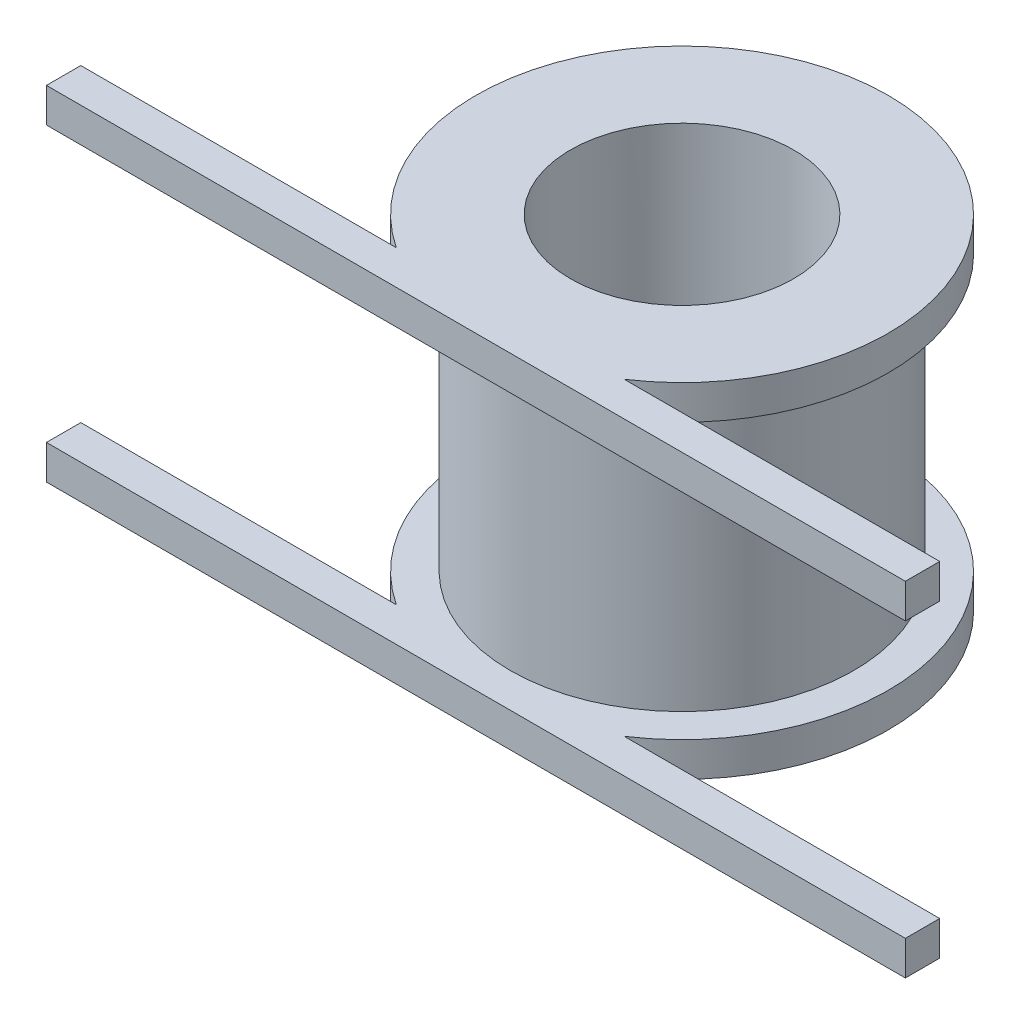
ISO-10303-21;
HEADER;
FILE_DESCRIPTION(('STEP AP214'),'2;1');
FILE_NAME('part.step','',(''),(''),'','','');
FILE_SCHEMA(('AUTOMOTIVE_DESIGN { 1 0 10303 214 1 1 1 1 }'));
ENDSEC;
DATA;
#1=APPLICATION_CONTEXT('core data for automotive mechanical design processes');
#2=APPLICATION_PROTOCOL_DEFINITION('international standard','automotive_design',2000,#1);
#3=PRODUCT_CONTEXT('',#1,'mechanical');
#4=PRODUCT('Part','Part','',(#3));
#5=PRODUCT_RELATED_PRODUCT_CATEGORY('part','',(#4));
#6=PRODUCT_DEFINITION_FORMATION('','',#4);
#7=PRODUCT_DEFINITION_CONTEXT('part definition',#1,'design');
#8=PRODUCT_DEFINITION('design','',#6,#7);
#9=PRODUCT_DEFINITION_SHAPE('','',#8);
#10=(LENGTH_UNIT() NAMED_UNIT(*) SI_UNIT(.MILLI.,.METRE.));
#11=(NAMED_UNIT(*) PLANE_ANGLE_UNIT() SI_UNIT($,.RADIAN.));
#12=(NAMED_UNIT(*) SI_UNIT($,.STERADIAN.) SOLID_ANGLE_UNIT());
#13=UNCERTAINTY_MEASURE_WITH_UNIT(LENGTH_MEASURE(1.E-05),#10,'distance_accuracy_value','');
#14=(GEOMETRIC_REPRESENTATION_CONTEXT(3) GLOBAL_UNCERTAINTY_ASSIGNED_CONTEXT((#13)) GLOBAL_UNIT_ASSIGNED_CONTEXT((#10,
#11,#12)) REPRESENTATION_CONTEXT('',''));
#15=CARTESIAN_POINT('',(0.,0.,0.));
#16=DIRECTION('',(0.,0.,1.));
#17=DIRECTION('',(1.,0.,0.));
#18=AXIS2_PLACEMENT_3D('',#15,#16,#17);
#19=CARTESIAN_POINT('',(0.,20.,10.));
#20=DIRECTION('',(0.,0.,-1.));
#21=DIRECTION('',(-1.,0.,0.));
#22=AXIS2_PLACEMENT_3D('',#19,#20,#21);
#23=PLANE('',#22);
#24=DIRECTION('',(0.,1.,0.));
#25=VECTOR('',#24,1.);
#26=CARTESIAN_POINT('',(-6.6332495807108,18.,10.));
#27=LINE('',#26,#25);
#28=CARTESIAN_POINT('',(-6.6332495807108,18.,10.));
#29=VERTEX_POINT('',#28);
#30=CARTESIAN_POINT('',(-6.6332495807108,20.,10.));
#31=VERTEX_POINT('',#30);
#32=EDGE_CURVE('E69',#29,#31,#27,.T.);
#33=ORIENTED_EDGE('',*,*,#32,.F.);
#34=DIRECTION('',(-1.,0.,0.));
#35=VECTOR('',#34,1.);
#36=CARTESIAN_POINT('',(25.,18.,10.));
#37=LINE('',#36,#35);
#38=CARTESIAN_POINT('',(-25.,18.,10.));
#39=VERTEX_POINT('',#38);
#40=EDGE_CURVE('E210',#29,#39,#37,.T.);
#41=ORIENTED_EDGE('',*,*,#40,.T.);
#42=DIRECTION('',(0.,-1.,0.));
#43=VECTOR('',#42,1.);
#44=CARTESIAN_POINT('',(-25.,20.,10.));
#45=LINE('',#44,#43);
#46=CARTESIAN_POINT('',(-25.,20.,10.));
#47=VERTEX_POINT('',#46);
#48=EDGE_CURVE('E226',#47,#39,#45,.T.);
#49=ORIENTED_EDGE('',*,*,#48,.F.);
#50=DIRECTION('',(1.,0.,0.));
#51=VECTOR('',#50,1.);
#52=CARTESIAN_POINT('',(0.,20.,10.));
#53=LINE('',#52,#51);
#54=EDGE_CURVE('E65',#47,#31,#53,.T.);
#55=ORIENTED_EDGE('',*,*,#54,.T.);
#56=EDGE_LOOP('',(#33,#41,#49,#55));
#57=FACE_BOUND('',#56,.T.);
#58=ADVANCED_FACE('F50',(#57),#23,.T.);
#59=CARTESIAN_POINT('',(0.,20.,0.));
#60=DIRECTION('',(0.,1.,0.));
#61=DIRECTION('',(0.,0.,1.));
#62=AXIS2_PLACEMENT_3D('',#59,#60,#61);
#63=PLANE('',#62);
#64=DIRECTION('',(1.,0.,0.));
#65=VECTOR('',#64,1.);
#66=CARTESIAN_POINT('',(0.,20.,12.));
#67=LINE('',#66,#65);
#68=CARTESIAN_POINT('',(-25.,20.,12.));
#69=VERTEX_POINT('',#68);
#70=CARTESIAN_POINT('',(25.,20.,12.));
#71=VERTEX_POINT('',#70);
#72=EDGE_CURVE('E218',#69,#71,#67,.T.);
#73=ORIENTED_EDGE('',*,*,#72,.T.);
#74=DIRECTION('',(0.,0.,1.));
#75=VECTOR('',#74,1.);
#76=CARTESIAN_POINT('',(25.,20.,0.));
#77=LINE('',#76,#75);
#78=CARTESIAN_POINT('',(25.,20.,10.));
#79=VERTEX_POINT('',#78);
#80=EDGE_CURVE('E209',#79,#71,#77,.T.);
#81=ORIENTED_EDGE('',*,*,#80,.F.);
#82=CARTESIAN_POINT('',(6.6332495807108,20.,10.));
#83=VERTEX_POINT('',#82);
#84=EDGE_CURVE('E214',#83,#79,#53,.T.);
#85=ORIENTED_EDGE('',*,*,#84,.F.);
#86=CARTESIAN_POINT('',(0.,20.,0.));
#87=DIRECTION('',(0.,1.,0.));
#88=DIRECTION('',(0.,0.,1.));
#89=AXIS2_PLACEMENT_3D('',#86,#87,#88);
#90=CIRCLE('',#89,12.);
#91=EDGE_CURVE('E190',#83,#31,#90,.T.);
#92=ORIENTED_EDGE('',*,*,#91,.T.);
#93=ORIENTED_EDGE('',*,*,#54,.F.);
#94=DIRECTION('',(0.,0.,1.));
#95=VECTOR('',#94,1.);
#96=CARTESIAN_POINT('',(-25.,20.,0.));
#97=LINE('',#96,#95);
#98=EDGE_CURVE('E216',#47,#69,#97,.T.);
#99=ORIENTED_EDGE('',*,*,#98,.T.);
#100=EDGE_LOOP('',(#73,#81,#85,#92,#93,#99));
#101=FACE_BOUND('',#100,.T.);
#102=CARTESIAN_POINT('',(0.,20.,0.));
#103=DIRECTION('',(0.,1.,0.));
#104=DIRECTION('',(0.,0.,1.));
#105=AXIS2_PLACEMENT_3D('',#102,#103,#104);
#106=CIRCLE('',#105,6.5);
#107=CARTESIAN_POINT('',(0.,20.,6.5));
#108=VERTEX_POINT('',#107);
#109=EDGE_CURVE('E187',#108,#108,#106,.T.);
#110=ORIENTED_EDGE('',*,*,#109,.F.);
#111=EDGE_LOOP('',(#110));
#112=FACE_BOUND('',#111,.T.);
#113=ADVANCED_FACE('F236',(#101,#112),#63,.T.);
#114=CARTESIAN_POINT('',(0.,20.,12.));
#115=DIRECTION('',(0.,0.,-1.));
#116=DIRECTION('',(-1.,0.,0.));
#117=AXIS2_PLACEMENT_3D('',#114,#115,#116);
#118=PLANE('',#117);
#119=DIRECTION('',(0.,-1.,0.));
#120=VECTOR('',#119,1.);
#121=CARTESIAN_POINT('',(-25.,20.,12.));
#122=LINE('',#121,#120);
#123=CARTESIAN_POINT('',(-25.,18.,12.));
#124=VERTEX_POINT('',#123);
#125=EDGE_CURVE('E223',#69,#124,#122,.T.);
#126=ORIENTED_EDGE('',*,*,#125,.T.);
#127=DIRECTION('',(-1.,0.,0.));
#128=VECTOR('',#127,1.);
#129=CARTESIAN_POINT('',(25.,18.,12.));
#130=LINE('',#129,#128);
#131=CARTESIAN_POINT('',(25.,18.,12.));
#132=VERTEX_POINT('',#131);
#133=EDGE_CURVE('E204',#132,#124,#130,.T.);
#134=ORIENTED_EDGE('',*,*,#133,.F.);
#135=DIRECTION('',(0.,-1.,0.));
#136=VECTOR('',#135,1.);
#137=CARTESIAN_POINT('',(25.,20.,12.));
#138=LINE('',#137,#136);
#139=EDGE_CURVE('E220',#71,#132,#138,.T.);
#140=ORIENTED_EDGE('',*,*,#139,.F.);
#141=ORIENTED_EDGE('',*,*,#72,.F.);
#142=EDGE_LOOP('',(#126,#134,#140,#141));
#143=FACE_BOUND('',#142,.T.);
#144=ADVANCED_FACE('F244',(#143),#118,.F.);
#145=CARTESIAN_POINT('',(-25.,20.,0.));
#146=DIRECTION('',(1.,0.,0.));
#147=DIRECTION('',(0.,0.,-1.));
#148=AXIS2_PLACEMENT_3D('',#145,#146,#147);
#149=PLANE('',#148);
#150=ORIENTED_EDGE('',*,*,#48,.T.);
#151=DIRECTION('',(0.,0.,-1.));
#152=VECTOR('',#151,1.);
#153=CARTESIAN_POINT('',(-25.,18.,12.));
#154=LINE('',#153,#152);
#155=EDGE_CURVE('E200',#124,#39,#154,.T.);
#156=ORIENTED_EDGE('',*,*,#155,.F.);
#157=ORIENTED_EDGE('',*,*,#125,.F.);
#158=ORIENTED_EDGE('',*,*,#98,.F.);
#159=EDGE_LOOP('',(#150,#156,#157,#158));
#160=FACE_BOUND('',#159,.T.);
#161=ADVANCED_FACE('F249',(#160),#149,.F.);
#162=DIRECTION('',(0.,1.,0.));
#163=VECTOR('',#162,1.);
#164=CARTESIAN_POINT('',(6.6332495807108,18.,10.));
#165=LINE('',#164,#163);
#166=CARTESIAN_POINT('',(6.6332495807108,18.,10.));
#167=VERTEX_POINT('',#166);
#168=EDGE_CURVE('E194',#83,#167,#165,.F.);
#169=ORIENTED_EDGE('',*,*,#168,.F.);
#170=ORIENTED_EDGE('',*,*,#84,.T.);
#171=DIRECTION('',(0.,-1.,0.));
#172=VECTOR('',#171,1.);
#173=CARTESIAN_POINT('',(25.,20.,10.));
#174=LINE('',#173,#172);
#175=CARTESIAN_POINT('',(25.,18.,10.));
#176=VERTEX_POINT('',#175);
#177=EDGE_CURVE('E58',#79,#176,#174,.T.);
#178=ORIENTED_EDGE('',*,*,#177,.T.);
#179=EDGE_CURVE('E207',#176,#167,#37,.T.);
#180=ORIENTED_EDGE('',*,*,#179,.T.);
#181=EDGE_LOOP('',(#169,#170,#178,#180));
#182=FACE_BOUND('',#181,.T.);
#183=ADVANCED_FACE('F232',(#182),#23,.T.);
#184=CARTESIAN_POINT('',(25.,20.,0.));
#185=DIRECTION('',(1.,0.,0.));
#186=DIRECTION('',(0.,0.,-1.));
#187=AXIS2_PLACEMENT_3D('',#184,#185,#186);
#188=PLANE('',#187);
#189=DIRECTION('',(0.,0.,-1.));
#190=VECTOR('',#189,1.);
#191=CARTESIAN_POINT('',(25.,18.,12.));
#192=LINE('',#191,#190);
#193=EDGE_CURVE('E201',#132,#176,#192,.T.);
#194=ORIENTED_EDGE('',*,*,#193,.T.);
#195=ORIENTED_EDGE('',*,*,#177,.F.);
#196=ORIENTED_EDGE('',*,*,#80,.T.);
#197=ORIENTED_EDGE('',*,*,#139,.T.);
#198=EDGE_LOOP('',(#194,#195,#196,#197));
#199=FACE_BOUND('',#198,.T.);
#200=ADVANCED_FACE('F52',(#199),#188,.T.);
#201=CARTESIAN_POINT('',(25.,18.,12.));
#202=DIRECTION('',(0.,1.,0.));
#203=DIRECTION('',(0.,0.,1.));
#204=AXIS2_PLACEMENT_3D('',#201,#202,#203);
#205=PLANE('',#204);
#206=CARTESIAN_POINT('',(0.,18.,0.));
#207=DIRECTION('',(0.,1.,0.));
#208=DIRECTION('',(0.,0.,1.));
#209=AXIS2_PLACEMENT_3D('',#206,#207,#208);
#210=CIRCLE('',#209,10.);
#211=CARTESIAN_POINT('',(0.,18.,10.));
#212=VERTEX_POINT('',#211);
#213=EDGE_CURVE('E12',#212,#212,#210,.F.);
#214=ORIENTED_EDGE('',*,*,#213,.F.);
#215=EDGE_LOOP('',(#214));
#216=FACE_BOUND('',#215,.T.);
#217=ORIENTED_EDGE('',*,*,#40,.F.);
#218=CARTESIAN_POINT('',(0.,18.,0.));
#219=DIRECTION('',(0.,1.,0.));
#220=DIRECTION('',(0.,0.,1.));
#221=AXIS2_PLACEMENT_3D('',#218,#219,#220);
#222=CIRCLE('',#221,12.);
#223=EDGE_CURVE('E191',#167,#29,#222,.T.);
#224=ORIENTED_EDGE('',*,*,#223,.F.);
#225=ORIENTED_EDGE('',*,*,#179,.F.);
#226=ORIENTED_EDGE('',*,*,#193,.F.);
#227=ORIENTED_EDGE('',*,*,#133,.T.);
#228=ORIENTED_EDGE('',*,*,#155,.T.);
#229=EDGE_LOOP('',(#217,#224,#225,#226,#227,#228));
#230=FACE_BOUND('',#229,.T.);
#231=ADVANCED_FACE('F247',(#216,#230),#205,.F.);
#232=CARTESIAN_POINT('',(0.,18.,0.));
#233=DIRECTION('',(0.,1.,0.));
#234=DIRECTION('',(0.,0.,1.));
#235=AXIS2_PLACEMENT_3D('',#232,#233,#234);
#236=CYLINDRICAL_SURFACE('',#235,12.);
#237=ORIENTED_EDGE('',*,*,#223,.T.);
#238=ORIENTED_EDGE('',*,*,#32,.T.);
#239=ORIENTED_EDGE('',*,*,#91,.F.);
#240=ORIENTED_EDGE('',*,*,#168,.T.);
#241=EDGE_LOOP('',(#237,#238,#239,#240));
#242=FACE_BOUND('',#241,.T.);
#243=ADVANCED_FACE('F252',(#242),#236,.T.);
#244=CARTESIAN_POINT('',(0.,18.,0.));
#245=DIRECTION('',(0.,1.,0.));
#246=DIRECTION('',(0.,0.,1.));
#247=AXIS2_PLACEMENT_3D('',#244,#245,#246);
#248=CYLINDRICAL_SURFACE('',#247,6.5);
#249=ORIENTED_EDGE('',*,*,#109,.T.);
#250=EDGE_LOOP('',(#249));
#251=FACE_BOUND('',#250,.T.);
#252=CARTESIAN_POINT('',(0.,0.,0.));
#253=DIRECTION('',(0.,-1.,0.));
#254=DIRECTION('',(0.,0.,-1.));
#255=AXIS2_PLACEMENT_3D('',#252,#253,#254);
#256=CIRCLE('',#255,6.5);
#257=CARTESIAN_POINT('',(0.,0.,-6.5));
#258=VERTEX_POINT('',#257);
#259=EDGE_CURVE('E407',#258,#258,#256,.T.);
#260=ORIENTED_EDGE('',*,*,#259,.T.);
#261=EDGE_LOOP('',(#260));
#262=FACE_BOUND('',#261,.T.);
#263=ADVANCED_FACE('F255',(#251,#262),#248,.F.);
#264=CARTESIAN_POINT('',(-25.,20.,0.));
#265=DIRECTION('',(1.,0.,0.));
#266=DIRECTION('',(0.,0.,-1.));
#267=AXIS2_PLACEMENT_3D('',#264,#265,#266);
#268=PLANE('',#267);
#269=DIRECTION('',(0.,-1.,0.));
#270=VECTOR('',#269,1.);
#271=CARTESIAN_POINT('',(-25.,20.,12.));
#272=LINE('',#271,#270);
#273=CARTESIAN_POINT('',(-25.,2.,12.));
#274=VERTEX_POINT('',#273);
#275=CARTESIAN_POINT('',(-25.,0.,12.));
#276=VERTEX_POINT('',#275);
#277=EDGE_CURVE('E141',#274,#276,#272,.T.);
#278=ORIENTED_EDGE('',*,*,#277,.F.);
#279=DIRECTION('',(0.,0.,1.));
#280=VECTOR('',#279,1.);
#281=CARTESIAN_POINT('',(-25.,2.,12.));
#282=LINE('',#281,#280);
#283=CARTESIAN_POINT('',(-25.,2.,10.));
#284=VERTEX_POINT('',#283);
#285=EDGE_CURVE('E150',#284,#274,#282,.T.);
#286=ORIENTED_EDGE('',*,*,#285,.F.);
#287=DIRECTION('',(0.,-1.,0.));
#288=VECTOR('',#287,1.);
#289=CARTESIAN_POINT('',(-25.,20.,10.));
#290=LINE('',#289,#288);
#291=CARTESIAN_POINT('',(-25.,0.,10.));
#292=VERTEX_POINT('',#291);
#293=EDGE_CURVE('E167',#284,#292,#290,.T.);
#294=ORIENTED_EDGE('',*,*,#293,.T.);
#295=DIRECTION('',(0.,0.,1.));
#296=VECTOR('',#295,1.);
#297=CARTESIAN_POINT('',(-25.,0.,0.));
#298=LINE('',#297,#296);
#299=EDGE_CURVE('E147',#292,#276,#298,.T.);
#300=ORIENTED_EDGE('',*,*,#299,.T.);
#301=EDGE_LOOP('',(#278,#286,#294,#300));
#302=FACE_BOUND('',#301,.T.);
#303=ADVANCED_FACE('F159',(#302),#268,.F.);
#304=CARTESIAN_POINT('',(25.,20.,0.));
#305=DIRECTION('',(1.,0.,0.));
#306=DIRECTION('',(0.,0.,-1.));
#307=AXIS2_PLACEMENT_3D('',#304,#305,#306);
#308=PLANE('',#307);
#309=DIRECTION('',(0.,0.,1.));
#310=VECTOR('',#309,1.);
#311=CARTESIAN_POINT('',(25.,2.,12.));
#312=LINE('',#311,#310);
#313=CARTESIAN_POINT('',(25.,2.,10.));
#314=VERTEX_POINT('',#313);
#315=CARTESIAN_POINT('',(25.,2.,12.));
#316=VERTEX_POINT('',#315);
#317=EDGE_CURVE('E171',#314,#316,#312,.T.);
#318=ORIENTED_EDGE('',*,*,#317,.T.);
#319=DIRECTION('',(0.,-1.,0.));
#320=VECTOR('',#319,1.);
#321=CARTESIAN_POINT('',(25.,20.,12.));
#322=LINE('',#321,#320);
#323=CARTESIAN_POINT('',(25.,0.,12.));
#324=VERTEX_POINT('',#323);
#325=EDGE_CURVE('E144',#316,#324,#322,.T.);
#326=ORIENTED_EDGE('',*,*,#325,.T.);
#327=DIRECTION('',(0.,0.,1.));
#328=VECTOR('',#327,1.);
#329=CARTESIAN_POINT('',(25.,0.,0.));
#330=LINE('',#329,#328);
#331=CARTESIAN_POINT('',(25.,0.,10.));
#332=VERTEX_POINT('',#331);
#333=EDGE_CURVE('E163',#332,#324,#330,.T.);
#334=ORIENTED_EDGE('',*,*,#333,.F.);
#335=DIRECTION('',(0.,-1.,0.));
#336=VECTOR('',#335,1.);
#337=CARTESIAN_POINT('',(25.,20.,10.));
#338=LINE('',#337,#336);
#339=EDGE_CURVE('E170',#314,#332,#338,.T.);
#340=ORIENTED_EDGE('',*,*,#339,.F.);
#341=EDGE_LOOP('',(#318,#326,#334,#340));
#342=FACE_BOUND('',#341,.T.);
#343=ADVANCED_FACE('F380',(#342),#308,.T.);
#344=CARTESIAN_POINT('',(0.,20.,12.));
#345=DIRECTION('',(0.,0.,-1.));
#346=DIRECTION('',(-1.,0.,0.));
#347=AXIS2_PLACEMENT_3D('',#344,#345,#346);
#348=PLANE('',#347);
#349=DIRECTION('',(-1.,0.,0.));
#350=VECTOR('',#349,1.);
#351=CARTESIAN_POINT('',(25.,2.,12.));
#352=LINE('',#351,#350);
#353=EDGE_CURVE('E137',#316,#274,#352,.T.);
#354=ORIENTED_EDGE('',*,*,#353,.T.);
#355=ORIENTED_EDGE('',*,*,#277,.T.);
#356=DIRECTION('',(1.,0.,0.));
#357=VECTOR('',#356,1.);
#358=CARTESIAN_POINT('',(0.,0.,12.));
#359=LINE('',#358,#357);
#360=EDGE_CURVE('E161',#276,#324,#359,.T.);
#361=ORIENTED_EDGE('',*,*,#360,.T.);
#362=ORIENTED_EDGE('',*,*,#325,.F.);
#363=EDGE_LOOP('',(#354,#355,#361,#362));
#364=FACE_BOUND('',#363,.T.);
#365=ADVANCED_FACE('F139',(#364),#348,.F.);
#366=CARTESIAN_POINT('',(0.,20.,10.));
#367=DIRECTION('',(0.,0.,-1.));
#368=DIRECTION('',(-1.,0.,0.));
#369=AXIS2_PLACEMENT_3D('',#366,#367,#368);
#370=PLANE('',#369);
#371=DIRECTION('',(0.,-1.,0.));
#372=VECTOR('',#371,1.);
#373=CARTESIAN_POINT('',(-6.6332495807108,2.,10.));
#374=LINE('',#373,#372);
#375=CARTESIAN_POINT('',(-6.6332495807108,0.,10.));
#376=VERTEX_POINT('',#375);
#377=CARTESIAN_POINT('',(-6.6332495807108,2.,10.));
#378=VERTEX_POINT('',#377);
#379=EDGE_CURVE('E172',#376,#378,#374,.F.);
#380=ORIENTED_EDGE('',*,*,#379,.F.);
#381=DIRECTION('',(1.,0.,0.));
#382=VECTOR('',#381,1.);
#383=CARTESIAN_POINT('',(0.,0.,10.));
#384=LINE('',#383,#382);
#385=EDGE_CURVE('E157',#292,#376,#384,.T.);
#386=ORIENTED_EDGE('',*,*,#385,.F.);
#387=ORIENTED_EDGE('',*,*,#293,.F.);
#388=DIRECTION('',(-1.,0.,0.));
#389=VECTOR('',#388,1.);
#390=CARTESIAN_POINT('',(25.,2.,10.));
#391=LINE('',#390,#389);
#392=EDGE_CURVE('E154',#378,#284,#391,.T.);
#393=ORIENTED_EDGE('',*,*,#392,.F.);
#394=EDGE_LOOP('',(#380,#386,#387,#393));
#395=FACE_BOUND('',#394,.T.);
#396=ADVANCED_FACE('F385',(#395),#370,.T.);
#397=DIRECTION('',(0.,-1.,0.));
#398=VECTOR('',#397,1.);
#399=CARTESIAN_POINT('',(6.6332495807108,2.,10.));
#400=LINE('',#399,#398);
#401=CARTESIAN_POINT('',(6.6332495807108,2.,10.));
#402=VERTEX_POINT('',#401);
#403=CARTESIAN_POINT('',(6.6332495807108,0.,10.));
#404=VERTEX_POINT('',#403);
#405=EDGE_CURVE('E175',#402,#404,#400,.T.);
#406=ORIENTED_EDGE('',*,*,#405,.F.);
#407=EDGE_CURVE('E176',#314,#402,#391,.T.);
#408=ORIENTED_EDGE('',*,*,#407,.F.);
#409=ORIENTED_EDGE('',*,*,#339,.T.);
#410=EDGE_CURVE('E399',#404,#332,#384,.T.);
#411=ORIENTED_EDGE('',*,*,#410,.F.);
#412=EDGE_LOOP('',(#406,#408,#409,#411));
#413=FACE_BOUND('',#412,.T.);
#414=ADVANCED_FACE('F351',(#413),#370,.T.);
#415=CARTESIAN_POINT('',(0.,0.,0.));
#416=DIRECTION('',(0.,1.,0.));
#417=DIRECTION('',(0.,0.,1.));
#418=AXIS2_PLACEMENT_3D('',#415,#416,#417);
#419=PLANE('',#418);
#420=ORIENTED_EDGE('',*,*,#259,.F.);
#421=EDGE_LOOP('',(#420));
#422=FACE_BOUND('',#421,.T.);
#423=CARTESIAN_POINT('',(0.,0.,0.));
#424=DIRECTION('',(0.,1.,0.));
#425=DIRECTION('',(0.,0.,1.));
#426=AXIS2_PLACEMENT_3D('',#423,#424,#425);
#427=CIRCLE('',#426,12.);
#428=EDGE_CURVE('E179',#404,#376,#427,.T.);
#429=ORIENTED_EDGE('',*,*,#428,.F.);
#430=ORIENTED_EDGE('',*,*,#410,.T.);
#431=ORIENTED_EDGE('',*,*,#333,.T.);
#432=ORIENTED_EDGE('',*,*,#360,.F.);
#433=ORIENTED_EDGE('',*,*,#299,.F.);
#434=ORIENTED_EDGE('',*,*,#385,.T.);
#435=EDGE_LOOP('',(#429,#430,#431,#432,#433,#434));
#436=FACE_BOUND('',#435,.T.);
#437=ADVANCED_FACE('F346',(#422,#436),#419,.F.);
#438=CARTESIAN_POINT('',(0.,2.,0.));
#439=DIRECTION('',(0.,-1.,0.));
#440=DIRECTION('',(0.,0.,-1.));
#441=AXIS2_PLACEMENT_3D('',#438,#439,#440);
#442=CYLINDRICAL_SURFACE('',#441,12.);
#443=CARTESIAN_POINT('',(0.,2.,0.));
#444=DIRECTION('',(0.,1.,0.));
#445=DIRECTION('',(0.,0.,1.));
#446=AXIS2_PLACEMENT_3D('',#443,#444,#445);
#447=CIRCLE('',#446,12.);
#448=EDGE_CURVE('E180',#402,#378,#447,.T.);
#449=ORIENTED_EDGE('',*,*,#448,.F.);
#450=ORIENTED_EDGE('',*,*,#405,.T.);
#451=ORIENTED_EDGE('',*,*,#428,.T.);
#452=ORIENTED_EDGE('',*,*,#379,.T.);
#453=EDGE_LOOP('',(#449,#450,#451,#452));
#454=FACE_BOUND('',#453,.T.);
#455=ADVANCED_FACE('F350',(#454),#442,.T.);
#456=CARTESIAN_POINT('',(0.,2.,0.));
#457=DIRECTION('',(0.,1.,0.));
#458=DIRECTION('',(0.,0.,1.));
#459=AXIS2_PLACEMENT_3D('',#456,#457,#458);
#460=PLANE('',#459);
#461=CARTESIAN_POINT('',(0.,2.,0.));
#462=DIRECTION('',(0.,1.,0.));
#463=DIRECTION('',(0.,0.,1.));
#464=AXIS2_PLACEMENT_3D('',#461,#462,#463);
#465=CIRCLE('',#464,10.);
#466=CARTESIAN_POINT('',(0.,2.,10.));
#467=VERTEX_POINT('',#466);
#468=EDGE_CURVE('E182',#467,#467,#465,.T.);
#469=ORIENTED_EDGE('',*,*,#468,.F.);
#470=EDGE_LOOP('',(#469));
#471=FACE_BOUND('',#470,.T.);
#472=ORIENTED_EDGE('',*,*,#407,.T.);
#473=ORIENTED_EDGE('',*,*,#448,.T.);
#474=ORIENTED_EDGE('',*,*,#392,.T.);
#475=ORIENTED_EDGE('',*,*,#285,.T.);
#476=ORIENTED_EDGE('',*,*,#353,.F.);
#477=ORIENTED_EDGE('',*,*,#317,.F.);
#478=EDGE_LOOP('',(#472,#473,#474,#475,#476,#477));
#479=FACE_BOUND('',#478,.T.);
#480=ADVANCED_FACE('F152',(#471,#479),#460,.T.);
#481=CARTESIAN_POINT('',(0.,20.,0.));
#482=DIRECTION('',(0.,-1.,0.));
#483=DIRECTION('',(0.,0.,-1.));
#484=AXIS2_PLACEMENT_3D('',#481,#482,#483);
#485=CYLINDRICAL_SURFACE('',#484,10.);
#486=ORIENTED_EDGE('',*,*,#468,.T.);
#487=EDGE_LOOP('',(#486));
#488=FACE_BOUND('',#487,.T.);
#489=ORIENTED_EDGE('',*,*,#213,.T.);
#490=EDGE_LOOP('',(#489));
#491=FACE_BOUND('',#490,.T.);
#492=ADVANCED_FACE('F342',(#488,#491),#485,.T.);
#493=CLOSED_SHELL('',(#58,#113,#144,#161,#183,#200,#231,#243,#263,#303,#343,#365,#396,#414,#437,
#455,#480,#492));
#494=MANIFOLD_SOLID_BREP('B2',#493);
#495=ADVANCED_BREP_SHAPE_REPRESENTATION('',(#18,#494),#14);
#496=SHAPE_DEFINITION_REPRESENTATION(#9,#495);
ENDSEC;
END-ISO-10303-21;
